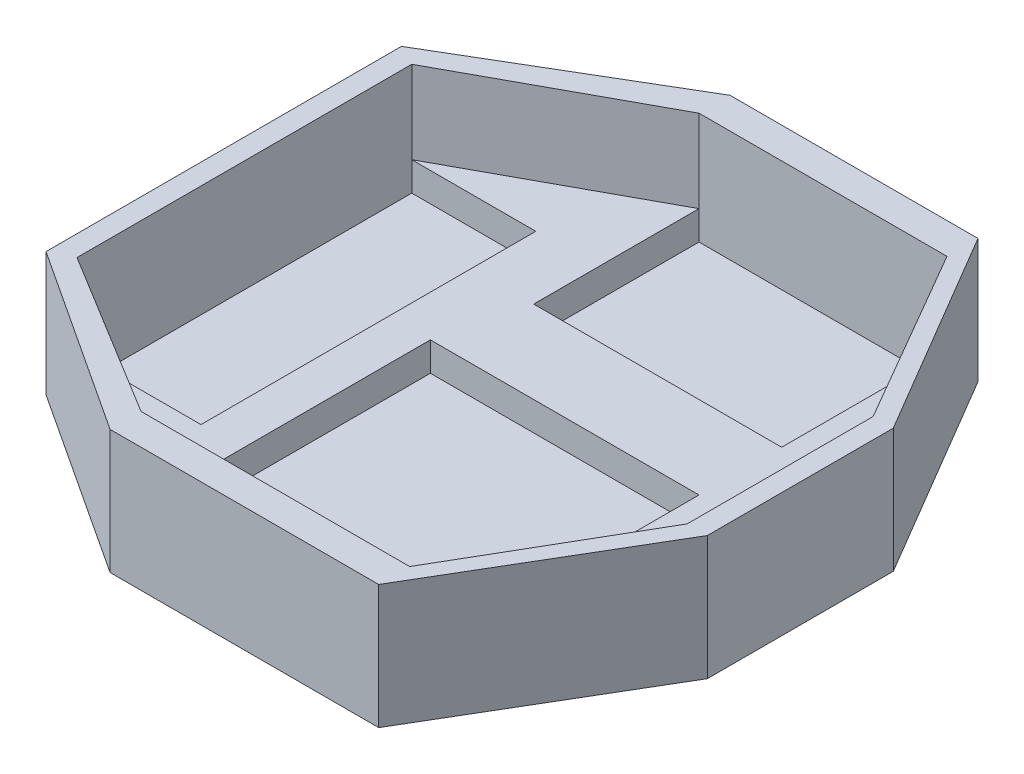
ISO-10303-21;
HEADER;
FILE_DESCRIPTION(('STEP AP214'),'2;1');
FILE_NAME('part.step','',(''),(''),'','','');
FILE_SCHEMA(('AUTOMOTIVE_DESIGN { 1 0 10303 214 1 1 1 1 }'));
ENDSEC;
DATA;
#1=APPLICATION_CONTEXT('core data for automotive mechanical design processes');
#2=APPLICATION_PROTOCOL_DEFINITION('international standard','automotive_design',2000,#1);
#3=PRODUCT_CONTEXT('',#1,'mechanical');
#4=PRODUCT('Part','Part','',(#3));
#5=PRODUCT_RELATED_PRODUCT_CATEGORY('part','',(#4));
#6=PRODUCT_DEFINITION_FORMATION('','',#4);
#7=PRODUCT_DEFINITION_CONTEXT('part definition',#1,'design');
#8=PRODUCT_DEFINITION('design','',#6,#7);
#9=PRODUCT_DEFINITION_SHAPE('','',#8);
#10=(LENGTH_UNIT() NAMED_UNIT(*) SI_UNIT(.MILLI.,.METRE.));
#11=(NAMED_UNIT(*) PLANE_ANGLE_UNIT() SI_UNIT($,.RADIAN.));
#12=(NAMED_UNIT(*) SI_UNIT($,.STERADIAN.) SOLID_ANGLE_UNIT());
#13=UNCERTAINTY_MEASURE_WITH_UNIT(LENGTH_MEASURE(1.E-05),#10,'distance_accuracy_value','');
#14=(GEOMETRIC_REPRESENTATION_CONTEXT(3) GLOBAL_UNCERTAINTY_ASSIGNED_CONTEXT((#13)) GLOBAL_UNIT_ASSIGNED_CONTEXT((#10,
#11,#12)) REPRESENTATION_CONTEXT('',''));
#15=CARTESIAN_POINT('',(0.,0.,0.));
#16=DIRECTION('',(0.,0.,1.));
#17=DIRECTION('',(1.,0.,0.));
#18=AXIS2_PLACEMENT_3D('',#15,#16,#17);
#19=CARTESIAN_POINT('',(0.,10.,0.));
#20=DIRECTION('',(0.,1.,0.));
#21=DIRECTION('',(0.,0.,1.));
#22=AXIS2_PLACEMENT_3D('',#19,#20,#21);
#23=PLANE('',#22);
#24=DIRECTION('',(0.,0.,1.));
#25=VECTOR('',#24,1.);
#26=CARTESIAN_POINT('',(-20.,10.,-65.));
#27=LINE('',#26,#25);
#28=CARTESIAN_POINT('',(-20.,10.,-65.));
#29=VERTEX_POINT('',#28);
#30=CARTESIAN_POINT('',(-20.,10.,-25.));
#31=VERTEX_POINT('',#30);
#32=EDGE_CURVE('E58',#29,#31,#27,.T.);
#33=ORIENTED_EDGE('',*,*,#32,.F.);
#34=DIRECTION('',(-0.878268244352051,0.,0.47816826636945));
#35=VECTOR('',#34,1.);
#36=CARTESIAN_POINT('',(-20.,10.,-65.));
#37=LINE('',#36,#35);
#38=CARTESIAN_POINT('',(-65.,10.,-40.5));
#39=VERTEX_POINT('',#38);
#40=EDGE_CURVE('E242',#29,#39,#37,.T.);
#41=ORIENTED_EDGE('',*,*,#40,.T.);
#42=DIRECTION('',(-1.,0.,0.));
#43=VECTOR('',#42,1.);
#44=CARTESIAN_POINT('',(-65.,10.,-40.5));
#45=LINE('',#44,#43);
#46=CARTESIAN_POINT('',(-35.,10.,-40.5));
#47=VERTEX_POINT('',#46);
#48=EDGE_CURVE('E392',#47,#39,#45,.T.);
#49=ORIENTED_EDGE('',*,*,#48,.F.);
#50=DIRECTION('',(0.,0.,-1.));
#51=VECTOR('',#50,1.);
#52=CARTESIAN_POINT('',(-35.,10.,-40.5));
#53=LINE('',#52,#51);
#54=CARTESIAN_POINT('',(-35.,10.,40.5));
#55=VERTEX_POINT('',#54);
#56=EDGE_CURVE('E403',#55,#47,#53,.T.);
#57=ORIENTED_EDGE('',*,*,#56,.F.);
#58=DIRECTION('',(1.,0.,0.));
#59=VECTOR('',#58,1.);
#60=CARTESIAN_POINT('',(-65.,10.,40.5));
#61=LINE('',#60,#59);
#62=CARTESIAN_POINT('',(-65.,10.,40.5));
#63=VERTEX_POINT('',#62);
#64=EDGE_CURVE('E381',#63,#55,#61,.T.);
#65=ORIENTED_EDGE('',*,*,#64,.F.);
#66=DIRECTION('',(0.85275441484345,0.,0.522312079091614));
#67=VECTOR('',#66,1.);
#68=CARTESIAN_POINT('',(-65.,10.,40.5));
#69=LINE('',#68,#67);
#70=CARTESIAN_POINT('',(-25.,10.,65.));
#71=VERTEX_POINT('',#70);
#72=EDGE_CURVE('E244',#63,#71,#69,.T.);
#73=ORIENTED_EDGE('',*,*,#72,.T.);
#74=DIRECTION('',(0.,0.,1.));
#75=VECTOR('',#74,1.);
#76=CARTESIAN_POINT('',(-25.,10.,-5.));
#77=LINE('',#76,#75);
#78=CARTESIAN_POINT('',(-25.,10.,-5.));
#79=VERTEX_POINT('',#78);
#80=EDGE_CURVE('E315',#79,#71,#77,.T.);
#81=ORIENTED_EDGE('',*,*,#80,.F.);
#82=DIRECTION('',(-1.,0.,0.));
#83=VECTOR('',#82,1.);
#84=CARTESIAN_POINT('',(-25.,10.,-5.));
#85=LINE('',#84,#83);
#86=CARTESIAN_POINT('',(40.,10.,-5.));
#87=VERTEX_POINT('',#86);
#88=EDGE_CURVE('E333',#87,#79,#85,.T.);
#89=ORIENTED_EDGE('',*,*,#88,.F.);
#90=DIRECTION('',(0.,0.,-1.));
#91=VECTOR('',#90,1.);
#92=CARTESIAN_POINT('',(40.,10.,-5.));
#93=LINE('',#92,#91);
#94=CARTESIAN_POINT('',(40.,10.,65.));
#95=VERTEX_POINT('',#94);
#96=EDGE_CURVE('E345',#95,#87,#93,.T.);
#97=ORIENTED_EDGE('',*,*,#96,.F.);
#98=DIRECTION('',(0.501240250057785,0.,-0.865308159976554));
#99=VECTOR('',#98,1.);
#100=CARTESIAN_POINT('',(40.,10.,65.));
#101=LINE('',#100,#99);
#102=CARTESIAN_POINT('',(64.6186406332203,10.,22.5));
#103=VERTEX_POINT('',#102);
#104=EDGE_CURVE('E247',#95,#103,#101,.T.);
#105=ORIENTED_EDGE('',*,*,#104,.T.);
#106=DIRECTION('',(0.,0.,-1.));
#107=VECTOR('',#106,1.);
#108=CARTESIAN_POINT('',(64.6186406332203,10.,22.5));
#109=LINE('',#108,#107);
#110=CARTESIAN_POINT('',(64.6186406332203,10.,-22.5000000000001));
#111=VERTEX_POINT('',#110);
#112=EDGE_CURVE('E250',#103,#111,#109,.T.);
#113=ORIENTED_EDGE('',*,*,#112,.T.);
#114=DIRECTION('',(-0.501240250057785,0.,-0.865308159976554));
#115=VECTOR('',#114,1.);
#116=CARTESIAN_POINT('',(64.6186406332203,10.,-22.5000000000001));
#117=LINE('',#116,#115);
#118=CARTESIAN_POINT('',(40.,10.,-65.));
#119=VERTEX_POINT('',#118);
#120=EDGE_CURVE('E214',#111,#119,#117,.T.);
#121=ORIENTED_EDGE('',*,*,#120,.T.);
#122=DIRECTION('',(0.,0.,-1.));
#123=VECTOR('',#122,1.);
#124=CARTESIAN_POINT('',(40.,10.,-65.));
#125=LINE('',#124,#123);
#126=CARTESIAN_POINT('',(40.,10.,-25.));
#127=VERTEX_POINT('',#126);
#128=EDGE_CURVE('E363',#127,#119,#125,.T.);
#129=ORIENTED_EDGE('',*,*,#128,.F.);
#130=DIRECTION('',(1.,0.,0.));
#131=VECTOR('',#130,1.);
#132=CARTESIAN_POINT('',(-20.,10.,-25.));
#133=LINE('',#132,#131);
#134=EDGE_CURVE('E374',#31,#127,#133,.T.);
#135=ORIENTED_EDGE('',*,*,#134,.F.);
#136=EDGE_LOOP('',(#33,#41,#49,#57,#65,#73,#81,#89,#97,#105,#113,#121,#129,#135));
#137=FACE_BOUND('',#136,.T.);
#138=ADVANCED_FACE('F33',(#137),#23,.T.);
#139=CARTESIAN_POINT('',(-65.,3.,-40.5));
#140=DIRECTION('',(-1.,0.,0.));
#141=DIRECTION('',(0.,0.,1.));
#142=AXIS2_PLACEMENT_3D('',#139,#140,#141);
#143=PLANE('',#142);
#144=DIRECTION('',(0.,1.,0.));
#145=VECTOR('',#144,1.);
#146=CARTESIAN_POINT('',(-65.,3.,-40.5));
#147=LINE('',#146,#145);
#148=CARTESIAN_POINT('',(-65.,3.,-40.5));
#149=VERTEX_POINT('',#148);
#150=EDGE_CURVE('E11',#149,#39,#147,.T.);
#151=ORIENTED_EDGE('',*,*,#150,.T.);
#152=DIRECTION('',(0.,-1.,0.));
#153=VECTOR('',#152,1.);
#154=CARTESIAN_POINT('',(-65.,30.,-40.5));
#155=LINE('',#154,#153);
#156=CARTESIAN_POINT('',(-65.,30.,-40.5));
#157=VERTEX_POINT('',#156);
#158=EDGE_CURVE('E206',#157,#39,#155,.T.);
#159=ORIENTED_EDGE('',*,*,#158,.F.);
#160=DIRECTION('',(0.,0.,1.));
#161=VECTOR('',#160,1.);
#162=CARTESIAN_POINT('',(-65.,30.,-40.5));
#163=LINE('',#162,#161);
#164=CARTESIAN_POINT('',(-65.,30.,40.5));
#165=VERTEX_POINT('',#164);
#166=EDGE_CURVE('E213',#157,#165,#163,.T.);
#167=ORIENTED_EDGE('',*,*,#166,.T.);
#168=DIRECTION('',(0.,-1.,0.));
#169=VECTOR('',#168,1.);
#170=CARTESIAN_POINT('',(-65.,30.,40.5));
#171=LINE('',#170,#169);
#172=EDGE_CURVE('E222',#165,#63,#171,.T.);
#173=ORIENTED_EDGE('',*,*,#172,.T.);
#174=DIRECTION('',(0.,1.,0.));
#175=VECTOR('',#174,1.);
#176=CARTESIAN_POINT('',(-65.,3.,40.5));
#177=LINE('',#176,#175);
#178=CARTESIAN_POINT('',(-65.,3.,40.5));
#179=VERTEX_POINT('',#178);
#180=EDGE_CURVE('E37',#179,#63,#177,.T.);
#181=ORIENTED_EDGE('',*,*,#180,.F.);
#182=DIRECTION('',(0.,0.,1.));
#183=VECTOR('',#182,1.);
#184=CARTESIAN_POINT('',(-65.,3.,-40.5));
#185=LINE('',#184,#183);
#186=EDGE_CURVE('E388',#149,#179,#185,.T.);
#187=ORIENTED_EDGE('',*,*,#186,.F.);
#188=EDGE_LOOP('',(#151,#159,#167,#173,#181,#187));
#189=FACE_BOUND('',#188,.T.);
#190=ADVANCED_FACE('F217',(#189),#143,.F.);
#191=CARTESIAN_POINT('',(-65.,3.,-40.5));
#192=DIRECTION('',(0.,0.,-1.));
#193=DIRECTION('',(-1.,0.,0.));
#194=AXIS2_PLACEMENT_3D('',#191,#192,#193);
#195=PLANE('',#194);
#196=ORIENTED_EDGE('',*,*,#48,.T.);
#197=ORIENTED_EDGE('',*,*,#150,.F.);
#198=DIRECTION('',(-1.,0.,0.));
#199=VECTOR('',#198,1.);
#200=CARTESIAN_POINT('',(-65.,3.,-40.5));
#201=LINE('',#200,#199);
#202=CARTESIAN_POINT('',(-35.,3.,-40.5));
#203=VERTEX_POINT('',#202);
#204=EDGE_CURVE('E398',#203,#149,#201,.T.);
#205=ORIENTED_EDGE('',*,*,#204,.F.);
#206=DIRECTION('',(0.,1.,0.));
#207=VECTOR('',#206,1.);
#208=CARTESIAN_POINT('',(-35.,3.,-40.5));
#209=LINE('',#208,#207);
#210=EDGE_CURVE('E42',#203,#47,#209,.T.);
#211=ORIENTED_EDGE('',*,*,#210,.T.);
#212=EDGE_LOOP('',(#196,#197,#205,#211));
#213=FACE_BOUND('',#212,.T.);
#214=ADVANCED_FACE('F425',(#213),#195,.F.);
#215=CARTESIAN_POINT('',(-35.,3.,-40.5));
#216=DIRECTION('',(1.,0.,0.));
#217=DIRECTION('',(0.,0.,-1.));
#218=AXIS2_PLACEMENT_3D('',#215,#216,#217);
#219=PLANE('',#218);
#220=ORIENTED_EDGE('',*,*,#56,.T.);
#221=ORIENTED_EDGE('',*,*,#210,.F.);
#222=DIRECTION('',(0.,0.,-1.));
#223=VECTOR('',#222,1.);
#224=CARTESIAN_POINT('',(-35.,3.,-40.5));
#225=LINE('',#224,#223);
#226=CARTESIAN_POINT('',(-35.,3.,40.5));
#227=VERTEX_POINT('',#226);
#228=EDGE_CURVE('E395',#227,#203,#225,.T.);
#229=ORIENTED_EDGE('',*,*,#228,.F.);
#230=DIRECTION('',(0.,1.,0.));
#231=VECTOR('',#230,1.);
#232=CARTESIAN_POINT('',(-35.,3.,40.5));
#233=LINE('',#232,#231);
#234=EDGE_CURVE('E407',#227,#55,#233,.T.);
#235=ORIENTED_EDGE('',*,*,#234,.T.);
#236=EDGE_LOOP('',(#220,#221,#229,#235));
#237=FACE_BOUND('',#236,.T.);
#238=ADVANCED_FACE('F420',(#237),#219,.F.);
#239=CARTESIAN_POINT('',(-65.,3.,40.5));
#240=DIRECTION('',(0.,0.,1.));
#241=DIRECTION('',(1.,0.,0.));
#242=AXIS2_PLACEMENT_3D('',#239,#240,#241);
#243=PLANE('',#242);
#244=ORIENTED_EDGE('',*,*,#64,.T.);
#245=ORIENTED_EDGE('',*,*,#234,.F.);
#246=DIRECTION('',(1.,0.,0.));
#247=VECTOR('',#246,1.);
#248=CARTESIAN_POINT('',(-65.,3.,40.5));
#249=LINE('',#248,#247);
#250=EDGE_CURVE('E391',#179,#227,#249,.T.);
#251=ORIENTED_EDGE('',*,*,#250,.F.);
#252=ORIENTED_EDGE('',*,*,#180,.T.);
#253=EDGE_LOOP('',(#244,#245,#251,#252));
#254=FACE_BOUND('',#253,.T.);
#255=ADVANCED_FACE('F414',(#254),#243,.F.);
#256=CARTESIAN_POINT('',(0.,3.,0.));
#257=DIRECTION('',(0.,1.,0.));
#258=DIRECTION('',(0.,0.,1.));
#259=AXIS2_PLACEMENT_3D('',#256,#257,#258);
#260=PLANE('',#259);
#261=ORIENTED_EDGE('',*,*,#186,.T.);
#262=ORIENTED_EDGE('',*,*,#250,.T.);
#263=ORIENTED_EDGE('',*,*,#228,.T.);
#264=ORIENTED_EDGE('',*,*,#204,.T.);
#265=EDGE_LOOP('',(#261,#262,#263,#264));
#266=FACE_BOUND('',#265,.T.);
#267=ADVANCED_FACE('F424',(#266),#260,.T.);
#268=CARTESIAN_POINT('',(-20.,3.,-65.));
#269=DIRECTION('',(-1.,0.,0.));
#270=DIRECTION('',(0.,0.,1.));
#271=AXIS2_PLACEMENT_3D('',#268,#269,#270);
#272=PLANE('',#271);
#273=ORIENTED_EDGE('',*,*,#32,.T.);
#274=DIRECTION('',(0.,1.,0.));
#275=VECTOR('',#274,1.);
#276=CARTESIAN_POINT('',(-20.,3.,-25.));
#277=LINE('',#276,#275);
#278=CARTESIAN_POINT('',(-20.,3.,-25.));
#279=VERTEX_POINT('',#278);
#280=EDGE_CURVE('E372',#279,#31,#277,.T.);
#281=ORIENTED_EDGE('',*,*,#280,.F.);
#282=DIRECTION('',(0.,0.,1.));
#283=VECTOR('',#282,1.);
#284=CARTESIAN_POINT('',(-20.,3.,-65.));
#285=LINE('',#284,#283);
#286=CARTESIAN_POINT('',(-20.,3.,-65.));
#287=VERTEX_POINT('',#286);
#288=EDGE_CURVE('E359',#287,#279,#285,.T.);
#289=ORIENTED_EDGE('',*,*,#288,.F.);
#290=DIRECTION('',(0.,1.,0.));
#291=VECTOR('',#290,1.);
#292=CARTESIAN_POINT('',(-20.,3.,-65.));
#293=LINE('',#292,#291);
#294=EDGE_CURVE('E379',#287,#29,#293,.T.);
#295=ORIENTED_EDGE('',*,*,#294,.T.);
#296=EDGE_LOOP('',(#273,#281,#289,#295));
#297=FACE_BOUND('',#296,.T.);
#298=ADVANCED_FACE('F443',(#297),#272,.F.);
#299=CARTESIAN_POINT('',(-20.,3.,-65.));
#300=DIRECTION('',(0.,0.,-1.));
#301=DIRECTION('',(-1.,0.,0.));
#302=AXIS2_PLACEMENT_3D('',#299,#300,#301);
#303=PLANE('',#302);
#304=DIRECTION('',(0.,1.,0.));
#305=VECTOR('',#304,1.);
#306=CARTESIAN_POINT('',(40.,3.,-65.));
#307=LINE('',#306,#305);
#308=CARTESIAN_POINT('',(40.,3.,-65.));
#309=VERTEX_POINT('',#308);
#310=EDGE_CURVE('E382',#309,#119,#307,.T.);
#311=ORIENTED_EDGE('',*,*,#310,.T.);
#312=DIRECTION('',(0.,-1.,0.));
#313=VECTOR('',#312,1.);
#314=CARTESIAN_POINT('',(40.,30.,-65.));
#315=LINE('',#314,#313);
#316=CARTESIAN_POINT('',(40.,30.,-65.));
#317=VERTEX_POINT('',#316);
#318=EDGE_CURVE('E256',#317,#119,#315,.T.);
#319=ORIENTED_EDGE('',*,*,#318,.F.);
#320=DIRECTION('',(-1.,0.,0.));
#321=VECTOR('',#320,1.);
#322=CARTESIAN_POINT('',(40.,30.,-65.));
#323=LINE('',#322,#321);
#324=CARTESIAN_POINT('',(-20.,30.,-65.));
#325=VERTEX_POINT('',#324);
#326=EDGE_CURVE('E240',#317,#325,#323,.T.);
#327=ORIENTED_EDGE('',*,*,#326,.T.);
#328=DIRECTION('',(0.,-1.,0.));
#329=VECTOR('',#328,1.);
#330=CARTESIAN_POINT('',(-20.,30.,-65.));
#331=LINE('',#330,#329);
#332=EDGE_CURVE('E209',#325,#29,#331,.T.);
#333=ORIENTED_EDGE('',*,*,#332,.T.);
#334=ORIENTED_EDGE('',*,*,#294,.F.);
#335=DIRECTION('',(-1.,0.,0.));
#336=VECTOR('',#335,1.);
#337=CARTESIAN_POINT('',(-20.,3.,-65.));
#338=LINE('',#337,#336);
#339=EDGE_CURVE('E369',#309,#287,#338,.T.);
#340=ORIENTED_EDGE('',*,*,#339,.F.);
#341=EDGE_LOOP('',(#311,#319,#327,#333,#334,#340));
#342=FACE_BOUND('',#341,.T.);
#343=ADVANCED_FACE('F447',(#342),#303,.F.);
#344=CARTESIAN_POINT('',(40.,3.,-65.));
#345=DIRECTION('',(1.,0.,0.));
#346=DIRECTION('',(0.,0.,-1.));
#347=AXIS2_PLACEMENT_3D('',#344,#345,#346);
#348=PLANE('',#347);
#349=ORIENTED_EDGE('',*,*,#128,.T.);
#350=ORIENTED_EDGE('',*,*,#310,.F.);
#351=DIRECTION('',(0.,0.,-1.));
#352=VECTOR('',#351,1.);
#353=CARTESIAN_POINT('',(40.,3.,-65.));
#354=LINE('',#353,#352);
#355=CARTESIAN_POINT('',(40.,3.,-25.));
#356=VERTEX_POINT('',#355);
#357=EDGE_CURVE('E366',#356,#309,#354,.T.);
#358=ORIENTED_EDGE('',*,*,#357,.F.);
#359=DIRECTION('',(0.,1.,0.));
#360=VECTOR('',#359,1.);
#361=CARTESIAN_POINT('',(40.,3.,-25.));
#362=LINE('',#361,#360);
#363=EDGE_CURVE('E385',#356,#127,#362,.T.);
#364=ORIENTED_EDGE('',*,*,#363,.T.);
#365=EDGE_LOOP('',(#349,#350,#358,#364));
#366=FACE_BOUND('',#365,.T.);
#367=ADVANCED_FACE('F454',(#366),#348,.F.);
#368=CARTESIAN_POINT('',(-20.,3.,-25.));
#369=DIRECTION('',(0.,0.,1.));
#370=DIRECTION('',(1.,0.,0.));
#371=AXIS2_PLACEMENT_3D('',#368,#369,#370);
#372=PLANE('',#371);
#373=ORIENTED_EDGE('',*,*,#134,.T.);
#374=ORIENTED_EDGE('',*,*,#363,.F.);
#375=DIRECTION('',(1.,0.,0.));
#376=VECTOR('',#375,1.);
#377=CARTESIAN_POINT('',(-20.,3.,-25.));
#378=LINE('',#377,#376);
#379=EDGE_CURVE('E362',#279,#356,#378,.T.);
#380=ORIENTED_EDGE('',*,*,#379,.F.);
#381=ORIENTED_EDGE('',*,*,#280,.T.);
#382=EDGE_LOOP('',(#373,#374,#380,#381));
#383=FACE_BOUND('',#382,.T.);
#384=ADVANCED_FACE('F450',(#383),#372,.F.);
#385=CARTESIAN_POINT('',(0.,3.,0.));
#386=DIRECTION('',(0.,1.,0.));
#387=DIRECTION('',(0.,0.,1.));
#388=AXIS2_PLACEMENT_3D('',#385,#386,#387);
#389=PLANE('',#388);
#390=ORIENTED_EDGE('',*,*,#288,.T.);
#391=ORIENTED_EDGE('',*,*,#379,.T.);
#392=ORIENTED_EDGE('',*,*,#357,.T.);
#393=ORIENTED_EDGE('',*,*,#339,.T.);
#394=EDGE_LOOP('',(#390,#391,#392,#393));
#395=FACE_BOUND('',#394,.T.);
#396=ADVANCED_FACE('F453',(#395),#389,.T.);
#397=CARTESIAN_POINT('',(-25.,3.,-5.));
#398=DIRECTION('',(-1.,0.,0.));
#399=DIRECTION('',(0.,0.,1.));
#400=AXIS2_PLACEMENT_3D('',#397,#398,#399);
#401=PLANE('',#400);
#402=ORIENTED_EDGE('',*,*,#80,.T.);
#403=DIRECTION('',(0.,1.,0.));
#404=VECTOR('',#403,1.);
#405=CARTESIAN_POINT('',(-25.,3.,65.));
#406=LINE('',#405,#404);
#407=CARTESIAN_POINT('',(-25.,3.,65.));
#408=VERTEX_POINT('',#407);
#409=EDGE_CURVE('E342',#408,#71,#406,.T.);
#410=ORIENTED_EDGE('',*,*,#409,.F.);
#411=DIRECTION('',(0.,0.,1.));
#412=VECTOR('',#411,1.);
#413=CARTESIAN_POINT('',(-25.,3.,-5.));
#414=LINE('',#413,#412);
#415=CARTESIAN_POINT('',(-25.,3.,-5.));
#416=VERTEX_POINT('',#415);
#417=EDGE_CURVE('E329',#416,#408,#414,.T.);
#418=ORIENTED_EDGE('',*,*,#417,.F.);
#419=DIRECTION('',(0.,1.,0.));
#420=VECTOR('',#419,1.);
#421=CARTESIAN_POINT('',(-25.,3.,-5.));
#422=LINE('',#421,#420);
#423=EDGE_CURVE('E350',#416,#79,#422,.T.);
#424=ORIENTED_EDGE('',*,*,#423,.T.);
#425=EDGE_LOOP('',(#402,#410,#418,#424));
#426=FACE_BOUND('',#425,.T.);
#427=ADVANCED_FACE('F464',(#426),#401,.F.);
#428=CARTESIAN_POINT('',(-25.,3.,-5.));
#429=DIRECTION('',(0.,0.,-1.));
#430=DIRECTION('',(-1.,0.,0.));
#431=AXIS2_PLACEMENT_3D('',#428,#429,#430);
#432=PLANE('',#431);
#433=ORIENTED_EDGE('',*,*,#88,.T.);
#434=ORIENTED_EDGE('',*,*,#423,.F.);
#435=DIRECTION('',(-1.,0.,0.));
#436=VECTOR('',#435,1.);
#437=CARTESIAN_POINT('',(-25.,3.,-5.));
#438=LINE('',#437,#436);
#439=CARTESIAN_POINT('',(40.,3.,-5.));
#440=VERTEX_POINT('',#439);
#441=EDGE_CURVE('E339',#440,#416,#438,.T.);
#442=ORIENTED_EDGE('',*,*,#441,.F.);
#443=DIRECTION('',(0.,1.,0.));
#444=VECTOR('',#443,1.);
#445=CARTESIAN_POINT('',(40.,3.,-5.));
#446=LINE('',#445,#444);
#447=EDGE_CURVE('E352',#440,#87,#446,.T.);
#448=ORIENTED_EDGE('',*,*,#447,.T.);
#449=EDGE_LOOP('',(#433,#434,#442,#448));
#450=FACE_BOUND('',#449,.T.);
#451=ADVANCED_FACE('F468',(#450),#432,.F.);
#452=CARTESIAN_POINT('',(40.,3.,-5.));
#453=DIRECTION('',(1.,0.,0.));
#454=DIRECTION('',(0.,0.,-1.));
#455=AXIS2_PLACEMENT_3D('',#452,#453,#454);
#456=PLANE('',#455);
#457=ORIENTED_EDGE('',*,*,#96,.T.);
#458=ORIENTED_EDGE('',*,*,#447,.F.);
#459=DIRECTION('',(0.,0.,-1.));
#460=VECTOR('',#459,1.);
#461=CARTESIAN_POINT('',(40.,3.,-5.));
#462=LINE('',#461,#460);
#463=CARTESIAN_POINT('',(40.,3.,65.));
#464=VERTEX_POINT('',#463);
#465=EDGE_CURVE('E336',#464,#440,#462,.T.);
#466=ORIENTED_EDGE('',*,*,#465,.F.);
#467=DIRECTION('',(0.,1.,0.));
#468=VECTOR('',#467,1.);
#469=CARTESIAN_POINT('',(40.,3.,65.));
#470=LINE('',#469,#468);
#471=EDGE_CURVE('E354',#464,#95,#470,.T.);
#472=ORIENTED_EDGE('',*,*,#471,.T.);
#473=EDGE_LOOP('',(#457,#458,#466,#472));
#474=FACE_BOUND('',#473,.T.);
#475=ADVANCED_FACE('F474',(#474),#456,.F.);
#476=CARTESIAN_POINT('',(-25.,3.,65.));
#477=DIRECTION('',(0.,0.,1.));
#478=DIRECTION('',(1.,0.,0.));
#479=AXIS2_PLACEMENT_3D('',#476,#477,#478);
#480=PLANE('',#479);
#481=ORIENTED_EDGE('',*,*,#409,.T.);
#482=DIRECTION('',(0.,-1.,0.));
#483=VECTOR('',#482,1.);
#484=CARTESIAN_POINT('',(-25.,30.,65.));
#485=LINE('',#484,#483);
#486=CARTESIAN_POINT('',(-25.,30.,65.));
#487=VERTEX_POINT('',#486);
#488=EDGE_CURVE('E264',#487,#71,#485,.T.);
#489=ORIENTED_EDGE('',*,*,#488,.F.);
#490=DIRECTION('',(1.,0.,0.));
#491=VECTOR('',#490,1.);
#492=CARTESIAN_POINT('',(-25.,30.,65.));
#493=LINE('',#492,#491);
#494=CARTESIAN_POINT('',(40.,30.,65.));
#495=VERTEX_POINT('',#494);
#496=EDGE_CURVE('E229',#487,#495,#493,.T.);
#497=ORIENTED_EDGE('',*,*,#496,.T.);
#498=DIRECTION('',(0.,-1.,0.));
#499=VECTOR('',#498,1.);
#500=CARTESIAN_POINT('',(40.,30.,65.));
#501=LINE('',#500,#499);
#502=EDGE_CURVE('E262',#495,#95,#501,.T.);
#503=ORIENTED_EDGE('',*,*,#502,.T.);
#504=ORIENTED_EDGE('',*,*,#471,.F.);
#505=DIRECTION('',(1.,0.,0.));
#506=VECTOR('',#505,1.);
#507=CARTESIAN_POINT('',(-25.,3.,65.));
#508=LINE('',#507,#506);
#509=EDGE_CURVE('E332',#408,#464,#508,.T.);
#510=ORIENTED_EDGE('',*,*,#509,.F.);
#511=EDGE_LOOP('',(#481,#489,#497,#503,#504,#510));
#512=FACE_BOUND('',#511,.T.);
#513=ADVANCED_FACE('F470',(#512),#480,.F.);
#514=CARTESIAN_POINT('',(0.,3.,0.));
#515=DIRECTION('',(0.,1.,0.));
#516=DIRECTION('',(0.,0.,1.));
#517=AXIS2_PLACEMENT_3D('',#514,#515,#516);
#518=PLANE('',#517);
#519=ORIENTED_EDGE('',*,*,#417,.T.);
#520=ORIENTED_EDGE('',*,*,#509,.T.);
#521=ORIENTED_EDGE('',*,*,#465,.T.);
#522=ORIENTED_EDGE('',*,*,#441,.T.);
#523=EDGE_LOOP('',(#519,#520,#521,#522));
#524=FACE_BOUND('',#523,.T.);
#525=ADVANCED_FACE('F473',(#524),#518,.T.);
#526=CARTESIAN_POINT('',(0.,30.,0.));
#527=DIRECTION('',(0.,-1.,0.));
#528=DIRECTION('',(0.,0.,-1.));
#529=AXIS2_PLACEMENT_3D('',#526,#527,#528);
#530=PLANE('',#529);
#531=DIRECTION('',(0.,0.,1.));
#532=VECTOR('',#531,1.);
#533=CARTESIAN_POINT('',(-70.,30.,43.));
#534=LINE('',#533,#532);
#535=CARTESIAN_POINT('',(-70.,30.,-43.));
#536=VERTEX_POINT('',#535);
#537=CARTESIAN_POINT('',(-70.,30.,43.));
#538=VERTEX_POINT('',#537);
#539=EDGE_CURVE('E221',#536,#538,#534,.T.);
#540=ORIENTED_EDGE('',*,*,#539,.T.);
#541=DIRECTION('',(0.836314214990172,0.,0.548250429826892));
#542=VECTOR('',#541,1.);
#543=CARTESIAN_POINT('',(-25.,30.,72.5));
#544=LINE('',#543,#542);
#545=CARTESIAN_POINT('',(-25.,30.,72.5));
#546=VERTEX_POINT('',#545);
#547=EDGE_CURVE('E269',#538,#546,#544,.T.);
#548=ORIENTED_EDGE('',*,*,#547,.T.);
#549=DIRECTION('',(1.,0.,0.));
#550=VECTOR('',#549,1.);
#551=CARTESIAN_POINT('',(40.,30.,72.5));
#552=LINE('',#551,#550);
#553=CARTESIAN_POINT('',(40.,30.,72.5));
#554=VERTEX_POINT('',#553);
#555=EDGE_CURVE('E272',#546,#554,#552,.T.);
#556=ORIENTED_EDGE('',*,*,#555,.T.);
#557=DIRECTION('',(0.508148861978286,0.,-0.861269257590315));
#558=VECTOR('',#557,1.);
#559=CARTESIAN_POINT('',(69.5,30.,22.5));
#560=LINE('',#559,#558);
#561=CARTESIAN_POINT('',(69.5,30.,22.5));
#562=VERTEX_POINT('',#561);
#563=EDGE_CURVE('E275',#554,#562,#560,.T.);
#564=ORIENTED_EDGE('',*,*,#563,.T.);
#565=DIRECTION('',(0.,0.,-1.));
#566=VECTOR('',#565,1.);
#567=CARTESIAN_POINT('',(69.5,30.,-22.5000000000001));
#568=LINE('',#567,#566);
#569=CARTESIAN_POINT('',(69.5,30.,-22.5000000000001));
#570=VERTEX_POINT('',#569);
#571=EDGE_CURVE('E278',#562,#570,#568,.T.);
#572=ORIENTED_EDGE('',*,*,#571,.T.);
#573=DIRECTION('',(-0.508148861978286,0.,-0.861269257590315));
#574=VECTOR('',#573,1.);
#575=CARTESIAN_POINT('',(40.,30.,-72.5));
#576=LINE('',#575,#574);
#577=CARTESIAN_POINT('',(40.,30.,-72.5));
#578=VERTEX_POINT('',#577);
#579=EDGE_CURVE('E281',#570,#578,#576,.T.);
#580=ORIENTED_EDGE('',*,*,#579,.T.);
#581=DIRECTION('',(-1.,0.,0.));
#582=VECTOR('',#581,1.);
#583=CARTESIAN_POINT('',(38.2575026724071,30.,-72.5));
#584=LINE('',#583,#582);
#585=CARTESIAN_POINT('',(-20.,30.,-72.5));
#586=VERTEX_POINT('',#585);
#587=EDGE_CURVE('E284',#578,#586,#584,.T.);
#588=ORIENTED_EDGE('',*,*,#587,.T.);
#589=DIRECTION('',(-0.861269257590315,0.,0.508148861978286));
#590=VECTOR('',#589,1.);
#591=CARTESIAN_POINT('',(-70.,30.,-43.));
#592=LINE('',#591,#590);
#593=EDGE_CURVE('E287',#586,#536,#592,.T.);
#594=ORIENTED_EDGE('',*,*,#593,.T.);
#595=EDGE_LOOP('',(#540,#548,#556,#564,#572,#580,#588,#594));
#596=FACE_BOUND('',#595,.T.);
#597=DIRECTION('',(-0.878268244352051,0.,0.47816826636945));
#598=VECTOR('',#597,1.);
#599=CARTESIAN_POINT('',(-20.,30.,-65.));
#600=LINE('',#599,#598);
#601=EDGE_CURVE('E203',#325,#157,#600,.T.);
#602=ORIENTED_EDGE('',*,*,#601,.F.);
#603=ORIENTED_EDGE('',*,*,#326,.F.);
#604=DIRECTION('',(-0.501240250057785,0.,-0.865308159976554));
#605=VECTOR('',#604,1.);
#606=CARTESIAN_POINT('',(64.6186406332203,30.,-22.5000000000001));
#607=LINE('',#606,#605);
#608=CARTESIAN_POINT('',(64.6186406332203,30.,-22.5000000000001));
#609=VERTEX_POINT('',#608);
#610=EDGE_CURVE('E237',#609,#317,#607,.T.);
#611=ORIENTED_EDGE('',*,*,#610,.F.);
#612=DIRECTION('',(0.,0.,-1.));
#613=VECTOR('',#612,1.);
#614=CARTESIAN_POINT('',(64.6186406332203,30.,22.5));
#615=LINE('',#614,#613);
#616=CARTESIAN_POINT('',(64.6186406332203,30.,22.5));
#617=VERTEX_POINT('',#616);
#618=EDGE_CURVE('E235',#617,#609,#615,.T.);
#619=ORIENTED_EDGE('',*,*,#618,.F.);
#620=DIRECTION('',(0.501240250057785,0.,-0.865308159976554));
#621=VECTOR('',#620,1.);
#622=CARTESIAN_POINT('',(40.,30.,65.));
#623=LINE('',#622,#621);
#624=EDGE_CURVE('E233',#495,#617,#623,.T.);
#625=ORIENTED_EDGE('',*,*,#624,.F.);
#626=ORIENTED_EDGE('',*,*,#496,.F.);
#627=DIRECTION('',(0.85275441484345,0.,0.522312079091614));
#628=VECTOR('',#627,1.);
#629=CARTESIAN_POINT('',(-65.,30.,40.5));
#630=LINE('',#629,#628);
#631=EDGE_CURVE('E227',#165,#487,#630,.T.);
#632=ORIENTED_EDGE('',*,*,#631,.F.);
#633=ORIENTED_EDGE('',*,*,#166,.F.);
#634=EDGE_LOOP('',(#602,#603,#611,#619,#625,#626,#632,#633));
#635=FACE_BOUND('',#634,.T.);
#636=ADVANCED_FACE('F225',(#596,#635),#530,.F.);
#637=CARTESIAN_POINT('',(-20.,30.,-65.));
#638=DIRECTION('',(0.47816826636945,0.,0.878268244352051));
#639=DIRECTION('',(0.878268244352051,0.,-0.47816826636945));
#640=AXIS2_PLACEMENT_3D('',#637,#638,#639);
#641=PLANE('',#640);
#642=ORIENTED_EDGE('',*,*,#40,.F.);
#643=ORIENTED_EDGE('',*,*,#332,.F.);
#644=ORIENTED_EDGE('',*,*,#601,.T.);
#645=ORIENTED_EDGE('',*,*,#158,.T.);
#646=EDGE_LOOP('',(#642,#643,#644,#645));
#647=FACE_BOUND('',#646,.T.);
#648=ADVANCED_FACE('F205',(#647),#641,.T.);
#649=CARTESIAN_POINT('',(-65.,30.,40.5));
#650=DIRECTION('',(0.522312079091614,0.,-0.852754414843451));
#651=DIRECTION('',(-0.852754414843451,0.,-0.522312079091614));
#652=AXIS2_PLACEMENT_3D('',#649,#650,#651);
#653=PLANE('',#652);
#654=ORIENTED_EDGE('',*,*,#72,.F.);
#655=ORIENTED_EDGE('',*,*,#172,.F.);
#656=ORIENTED_EDGE('',*,*,#631,.T.);
#657=ORIENTED_EDGE('',*,*,#488,.T.);
#658=EDGE_LOOP('',(#654,#655,#656,#657));
#659=FACE_BOUND('',#658,.T.);
#660=ADVANCED_FACE('F521',(#659),#653,.T.);
#661=CARTESIAN_POINT('',(40.,30.,65.));
#662=DIRECTION('',(-0.865308159976554,0.,-0.501240250057785));
#663=DIRECTION('',(-0.501240250057785,0.,0.865308159976554));
#664=AXIS2_PLACEMENT_3D('',#661,#662,#663);
#665=PLANE('',#664);
#666=ORIENTED_EDGE('',*,*,#104,.F.);
#667=ORIENTED_EDGE('',*,*,#502,.F.);
#668=ORIENTED_EDGE('',*,*,#624,.T.);
#669=DIRECTION('',(0.,-1.,0.));
#670=VECTOR('',#669,1.);
#671=CARTESIAN_POINT('',(64.6186406332203,30.,22.5));
#672=LINE('',#671,#670);
#673=EDGE_CURVE('E260',#617,#103,#672,.T.);
#674=ORIENTED_EDGE('',*,*,#673,.T.);
#675=EDGE_LOOP('',(#666,#667,#668,#674));
#676=FACE_BOUND('',#675,.T.);
#677=ADVANCED_FACE('F524',(#676),#665,.T.);
#678=CARTESIAN_POINT('',(64.6186406332203,30.,22.5));
#679=DIRECTION('',(-1.,0.,0.));
#680=DIRECTION('',(0.,0.,1.));
#681=AXIS2_PLACEMENT_3D('',#678,#679,#680);
#682=PLANE('',#681);
#683=ORIENTED_EDGE('',*,*,#112,.F.);
#684=ORIENTED_EDGE('',*,*,#673,.F.);
#685=ORIENTED_EDGE('',*,*,#618,.T.);
#686=DIRECTION('',(0.,-1.,0.));
#687=VECTOR('',#686,1.);
#688=CARTESIAN_POINT('',(64.6186406332203,30.,-22.5000000000001));
#689=LINE('',#688,#687);
#690=EDGE_CURVE('E258',#609,#111,#689,.T.);
#691=ORIENTED_EDGE('',*,*,#690,.T.);
#692=EDGE_LOOP('',(#683,#684,#685,#691));
#693=FACE_BOUND('',#692,.T.);
#694=ADVANCED_FACE('F528',(#693),#682,.T.);
#695=CARTESIAN_POINT('',(64.6186406332203,30.,-22.5000000000001));
#696=DIRECTION('',(-0.865308159976554,0.,0.501240250057785));
#697=DIRECTION('',(0.501240250057785,0.,0.865308159976554));
#698=AXIS2_PLACEMENT_3D('',#695,#696,#697);
#699=PLANE('',#698);
#700=ORIENTED_EDGE('',*,*,#120,.F.);
#701=ORIENTED_EDGE('',*,*,#690,.F.);
#702=ORIENTED_EDGE('',*,*,#610,.T.);
#703=ORIENTED_EDGE('',*,*,#318,.T.);
#704=EDGE_LOOP('',(#700,#701,#702,#703));
#705=FACE_BOUND('',#704,.T.);
#706=ADVANCED_FACE('F532',(#705),#699,.T.);
#707=CARTESIAN_POINT('',(0.,0.,0.));
#708=DIRECTION('',(0.,1.,0.));
#709=DIRECTION('',(0.,0.,1.));
#710=AXIS2_PLACEMENT_3D('',#707,#708,#709);
#711=PLANE('',#710);
#712=DIRECTION('',(0.,0.,1.));
#713=VECTOR('',#712,1.);
#714=CARTESIAN_POINT('',(-70.,0.,43.));
#715=LINE('',#714,#713);
#716=CARTESIAN_POINT('',(-70.,0.,-43.));
#717=VERTEX_POINT('',#716);
#718=CARTESIAN_POINT('',(-70.,0.,43.));
#719=VERTEX_POINT('',#718);
#720=EDGE_CURVE('E50',#717,#719,#715,.T.);
#721=ORIENTED_EDGE('',*,*,#720,.F.);
#722=DIRECTION('',(-0.861269257590315,0.,0.508148861978286));
#723=VECTOR('',#722,1.);
#724=CARTESIAN_POINT('',(-70.,0.,-43.));
#725=LINE('',#724,#723);
#726=CARTESIAN_POINT('',(-20.,0.,-72.5));
#727=VERTEX_POINT('',#726);
#728=EDGE_CURVE('E309',#727,#717,#725,.T.);
#729=ORIENTED_EDGE('',*,*,#728,.F.);
#730=DIRECTION('',(-1.,0.,0.));
#731=VECTOR('',#730,1.);
#732=CARTESIAN_POINT('',(-20.,0.,-72.5));
#733=LINE('',#732,#731);
#734=CARTESIAN_POINT('',(40.,0.,-72.5));
#735=VERTEX_POINT('',#734);
#736=EDGE_CURVE('E306',#735,#727,#733,.T.);
#737=ORIENTED_EDGE('',*,*,#736,.F.);
#738=DIRECTION('',(-0.508148861978286,0.,-0.861269257590315));
#739=VECTOR('',#738,1.);
#740=CARTESIAN_POINT('',(40.,0.,-72.5));
#741=LINE('',#740,#739);
#742=CARTESIAN_POINT('',(69.5,0.,-22.5000000000001));
#743=VERTEX_POINT('',#742);
#744=EDGE_CURVE('E303',#743,#735,#741,.T.);
#745=ORIENTED_EDGE('',*,*,#744,.F.);
#746=DIRECTION('',(0.,0.,-1.));
#747=VECTOR('',#746,1.);
#748=CARTESIAN_POINT('',(69.5,0.,-22.5000000000001));
#749=LINE('',#748,#747);
#750=CARTESIAN_POINT('',(69.5,0.,22.5));
#751=VERTEX_POINT('',#750);
#752=EDGE_CURVE('E300',#751,#743,#749,.T.);
#753=ORIENTED_EDGE('',*,*,#752,.F.);
#754=DIRECTION('',(0.508148861978286,0.,-0.861269257590315));
#755=VECTOR('',#754,1.);
#756=CARTESIAN_POINT('',(40.,0.,72.5));
#757=LINE('',#756,#755);
#758=CARTESIAN_POINT('',(40.,0.,72.5));
#759=VERTEX_POINT('',#758);
#760=EDGE_CURVE('E297',#759,#751,#757,.T.);
#761=ORIENTED_EDGE('',*,*,#760,.F.);
#762=DIRECTION('',(1.,0.,0.));
#763=VECTOR('',#762,1.);
#764=CARTESIAN_POINT('',(-25.,0.,72.5));
#765=LINE('',#764,#763);
#766=CARTESIAN_POINT('',(-25.,0.,72.5));
#767=VERTEX_POINT('',#766);
#768=EDGE_CURVE('E294',#767,#759,#765,.T.);
#769=ORIENTED_EDGE('',*,*,#768,.F.);
#770=DIRECTION('',(0.836314214990173,0.,0.548250429826892));
#771=VECTOR('',#770,1.);
#772=CARTESIAN_POINT('',(-25.,0.,72.5));
#773=LINE('',#772,#771);
#774=EDGE_CURVE('E291',#719,#767,#773,.T.);
#775=ORIENTED_EDGE('',*,*,#774,.F.);
#776=EDGE_LOOP('',(#721,#729,#737,#745,#753,#761,#769,#775));
#777=FACE_BOUND('',#776,.T.);
#778=ADVANCED_FACE('F35',(#777),#711,.F.);
#779=CARTESIAN_POINT('',(-20.,0.,-72.5));
#780=DIRECTION('',(0.,0.,-1.));
#781=DIRECTION('',(-1.,0.,0.));
#782=AXIS2_PLACEMENT_3D('',#779,#780,#781);
#783=PLANE('',#782);
#784=DIRECTION('',(0.,1.,0.));
#785=VECTOR('',#784,1.);
#786=CARTESIAN_POINT('',(-20.,0.,-72.5));
#787=LINE('',#786,#785);
#788=EDGE_CURVE('E316',#727,#586,#787,.T.);
#789=ORIENTED_EDGE('',*,*,#788,.T.);
#790=ORIENTED_EDGE('',*,*,#587,.F.);
#791=DIRECTION('',(0.,1.,0.));
#792=VECTOR('',#791,1.);
#793=CARTESIAN_POINT('',(40.,0.,-72.5));
#794=LINE('',#793,#792);
#795=EDGE_CURVE('E318',#735,#578,#794,.T.);
#796=ORIENTED_EDGE('',*,*,#795,.F.);
#797=ORIENTED_EDGE('',*,*,#736,.T.);
#798=EDGE_LOOP('',(#789,#790,#796,#797));
#799=FACE_BOUND('',#798,.T.);
#800=ADVANCED_FACE('F508',(#799),#783,.T.);
#801=CARTESIAN_POINT('',(40.,0.,-72.5));
#802=DIRECTION('',(0.861269257590315,0.,-0.508148861978286));
#803=DIRECTION('',(-0.508148861978286,0.,-0.861269257590315));
#804=AXIS2_PLACEMENT_3D('',#801,#802,#803);
#805=PLANE('',#804);
#806=ORIENTED_EDGE('',*,*,#795,.T.);
#807=ORIENTED_EDGE('',*,*,#579,.F.);
#808=DIRECTION('',(0.,1.,0.));
#809=VECTOR('',#808,1.);
#810=CARTESIAN_POINT('',(69.5,0.,-22.5000000000001));
#811=LINE('',#810,#809);
#812=EDGE_CURVE('E320',#743,#570,#811,.T.);
#813=ORIENTED_EDGE('',*,*,#812,.F.);
#814=ORIENTED_EDGE('',*,*,#744,.T.);
#815=EDGE_LOOP('',(#806,#807,#813,#814));
#816=FACE_BOUND('',#815,.T.);
#817=ADVANCED_FACE('F504',(#816),#805,.T.);
#818=CARTESIAN_POINT('',(69.5,0.,-22.5000000000001));
#819=DIRECTION('',(1.,0.,0.));
#820=DIRECTION('',(0.,0.,-1.));
#821=AXIS2_PLACEMENT_3D('',#818,#819,#820);
#822=PLANE('',#821);
#823=ORIENTED_EDGE('',*,*,#812,.T.);
#824=ORIENTED_EDGE('',*,*,#571,.F.);
#825=DIRECTION('',(0.,1.,0.));
#826=VECTOR('',#825,1.);
#827=CARTESIAN_POINT('',(69.5,0.,22.5));
#828=LINE('',#827,#826);
#829=EDGE_CURVE('E322',#751,#562,#828,.T.);
#830=ORIENTED_EDGE('',*,*,#829,.F.);
#831=ORIENTED_EDGE('',*,*,#752,.T.);
#832=EDGE_LOOP('',(#823,#824,#830,#831));
#833=FACE_BOUND('',#832,.T.);
#834=ADVANCED_FACE('F500',(#833),#822,.T.);
#835=CARTESIAN_POINT('',(40.,0.,72.5));
#836=DIRECTION('',(0.861269257590315,0.,0.508148861978286));
#837=DIRECTION('',(0.508148861978286,0.,-0.861269257590315));
#838=AXIS2_PLACEMENT_3D('',#835,#836,#837);
#839=PLANE('',#838);
#840=ORIENTED_EDGE('',*,*,#829,.T.);
#841=ORIENTED_EDGE('',*,*,#563,.F.);
#842=DIRECTION('',(0.,1.,0.));
#843=VECTOR('',#842,1.);
#844=CARTESIAN_POINT('',(40.,0.,72.5));
#845=LINE('',#844,#843);
#846=EDGE_CURVE('E324',#759,#554,#845,.T.);
#847=ORIENTED_EDGE('',*,*,#846,.F.);
#848=ORIENTED_EDGE('',*,*,#760,.T.);
#849=EDGE_LOOP('',(#840,#841,#847,#848));
#850=FACE_BOUND('',#849,.T.);
#851=ADVANCED_FACE('F496',(#850),#839,.T.);
#852=CARTESIAN_POINT('',(-25.,0.,72.5));
#853=DIRECTION('',(0.,0.,1.));
#854=DIRECTION('',(1.,0.,0.));
#855=AXIS2_PLACEMENT_3D('',#852,#853,#854);
#856=PLANE('',#855);
#857=ORIENTED_EDGE('',*,*,#846,.T.);
#858=ORIENTED_EDGE('',*,*,#555,.F.);
#859=DIRECTION('',(0.,1.,0.));
#860=VECTOR('',#859,1.);
#861=CARTESIAN_POINT('',(-25.,0.,72.5));
#862=LINE('',#861,#860);
#863=EDGE_CURVE('E326',#767,#546,#862,.T.);
#864=ORIENTED_EDGE('',*,*,#863,.F.);
#865=ORIENTED_EDGE('',*,*,#768,.T.);
#866=EDGE_LOOP('',(#857,#858,#864,#865));
#867=FACE_BOUND('',#866,.T.);
#868=ADVANCED_FACE('F492',(#867),#856,.T.);
#869=CARTESIAN_POINT('',(-25.,0.,72.5));
#870=DIRECTION('',(-0.548250429826892,0.,0.836314214990173));
#871=DIRECTION('',(0.836314214990173,0.,0.548250429826892));
#872=AXIS2_PLACEMENT_3D('',#869,#870,#871);
#873=PLANE('',#872);
#874=ORIENTED_EDGE('',*,*,#863,.T.);
#875=ORIENTED_EDGE('',*,*,#547,.F.);
#876=DIRECTION('',(0.,1.,0.));
#877=VECTOR('',#876,1.);
#878=CARTESIAN_POINT('',(-70.,0.,43.));
#879=LINE('',#878,#877);
#880=EDGE_CURVE('E312',#719,#538,#879,.T.);
#881=ORIENTED_EDGE('',*,*,#880,.F.);
#882=ORIENTED_EDGE('',*,*,#774,.T.);
#883=EDGE_LOOP('',(#874,#875,#881,#882));
#884=FACE_BOUND('',#883,.T.);
#885=ADVANCED_FACE('F489',(#884),#873,.T.);
#886=CARTESIAN_POINT('',(-70.,0.,43.));
#887=DIRECTION('',(-1.,0.,0.));
#888=DIRECTION('',(0.,0.,1.));
#889=AXIS2_PLACEMENT_3D('',#886,#887,#888);
#890=PLANE('',#889);
#891=ORIENTED_EDGE('',*,*,#880,.T.);
#892=ORIENTED_EDGE('',*,*,#539,.F.);
#893=DIRECTION('',(0.,1.,0.));
#894=VECTOR('',#893,1.);
#895=CARTESIAN_POINT('',(-70.,0.,-43.));
#896=LINE('',#895,#894);
#897=EDGE_CURVE('E313',#717,#536,#896,.T.);
#898=ORIENTED_EDGE('',*,*,#897,.F.);
#899=ORIENTED_EDGE('',*,*,#720,.T.);
#900=EDGE_LOOP('',(#891,#892,#898,#899));
#901=FACE_BOUND('',#900,.T.);
#902=ADVANCED_FACE('F485',(#901),#890,.T.);
#903=CARTESIAN_POINT('',(-70.,0.,-43.));
#904=DIRECTION('',(-0.508148861978286,0.,-0.861269257590315));
#905=DIRECTION('',(-0.861269257590315,0.,0.508148861978286));
#906=AXIS2_PLACEMENT_3D('',#903,#904,#905);
#907=PLANE('',#906);
#908=ORIENTED_EDGE('',*,*,#897,.T.);
#909=ORIENTED_EDGE('',*,*,#593,.F.);
#910=ORIENTED_EDGE('',*,*,#788,.F.);
#911=ORIENTED_EDGE('',*,*,#728,.T.);
#912=EDGE_LOOP('',(#908,#909,#910,#911));
#913=FACE_BOUND('',#912,.T.);
#914=ADVANCED_FACE('F488',(#913),#907,.T.);
#915=CLOSED_SHELL('',(#138,#190,#214,#238,#255,#267,#298,#343,#367,#384,#396,#427,#451,#475,
#513,#525,#636,#648,#660,#677,#694,#706,#778,#800,#817,#834,#851,#868,#885,#902,#914));
#916=MANIFOLD_SOLID_BREP('B2',#915);
#917=ADVANCED_BREP_SHAPE_REPRESENTATION('',(#18,#916),#14);
#918=SHAPE_DEFINITION_REPRESENTATION(#9,#917);
ENDSEC;
END-ISO-10303-21;
